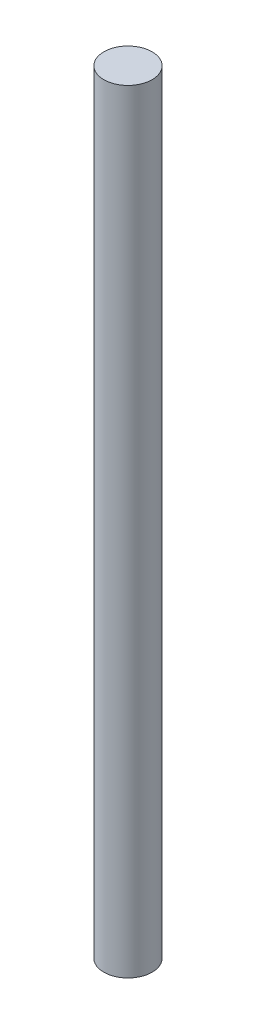
ISO-10303-21;
HEADER;
FILE_DESCRIPTION(('STEP AP214'),'2;1');
FILE_NAME('part.step','',(''),(''),'','','');
FILE_SCHEMA(('AUTOMOTIVE_DESIGN { 1 0 10303 214 1 1 1 1 }'));
ENDSEC;
DATA;
#1=APPLICATION_CONTEXT('core data for automotive mechanical design processes');
#2=APPLICATION_PROTOCOL_DEFINITION('international standard','automotive_design',2000,#1);
#3=PRODUCT_CONTEXT('',#1,'mechanical');
#4=PRODUCT('Part','Part','',(#3));
#5=PRODUCT_RELATED_PRODUCT_CATEGORY('part','',(#4));
#6=PRODUCT_DEFINITION_FORMATION('','',#4);
#7=PRODUCT_DEFINITION_CONTEXT('part definition',#1,'design');
#8=PRODUCT_DEFINITION('design','',#6,#7);
#9=PRODUCT_DEFINITION_SHAPE('','',#8);
#10=(LENGTH_UNIT() NAMED_UNIT(*) SI_UNIT(.MILLI.,.METRE.));
#11=(NAMED_UNIT(*) PLANE_ANGLE_UNIT() SI_UNIT($,.RADIAN.));
#12=(NAMED_UNIT(*) SI_UNIT($,.STERADIAN.) SOLID_ANGLE_UNIT());
#13=UNCERTAINTY_MEASURE_WITH_UNIT(LENGTH_MEASURE(1.E-05),#10,'distance_accuracy_value','');
#14=(GEOMETRIC_REPRESENTATION_CONTEXT(3) GLOBAL_UNCERTAINTY_ASSIGNED_CONTEXT((#13)) GLOBAL_UNIT_ASSIGNED_CONTEXT((#10,
#11,#12)) REPRESENTATION_CONTEXT('',''));
#15=CARTESIAN_POINT('',(0.,0.,0.));
#16=DIRECTION('',(0.,0.,1.));
#17=DIRECTION('',(1.,0.,0.));
#18=AXIS2_PLACEMENT_3D('',#15,#16,#17);
#19=CARTESIAN_POINT('',(0.,304.8,0.));
#20=DIRECTION('',(0.,-1.,0.));
#21=DIRECTION('',(0.,0.,-1.));
#22=AXIS2_PLACEMENT_3D('',#19,#20,#21);
#23=CYLINDRICAL_SURFACE('',#22,9.525);
#24=CARTESIAN_POINT('',(0.,304.8,0.));
#25=DIRECTION('',(0.,1.,0.));
#26=DIRECTION('',(0.,0.,1.));
#27=AXIS2_PLACEMENT_3D('',#24,#25,#26);
#28=CIRCLE('',#27,9.525);
#29=CARTESIAN_POINT('',(0.,304.8,9.525));
#30=VERTEX_POINT('',#29);
#31=EDGE_CURVE('E10',#30,#30,#28,.T.);
#32=ORIENTED_EDGE('',*,*,#31,.F.);
#33=EDGE_LOOP('',(#32));
#34=FACE_BOUND('',#33,.T.);
#35=CARTESIAN_POINT('',(0.,0.,0.));
#36=DIRECTION('',(0.,1.,0.));
#37=DIRECTION('',(0.,0.,1.));
#38=AXIS2_PLACEMENT_3D('',#35,#36,#37);
#39=CIRCLE('',#38,9.525);
#40=CARTESIAN_POINT('',(0.,0.,9.525));
#41=VERTEX_POINT('',#40);
#42=EDGE_CURVE('E36',#41,#41,#39,.T.);
#43=ORIENTED_EDGE('',*,*,#42,.T.);
#44=EDGE_LOOP('',(#43));
#45=FACE_BOUND('',#44,.T.);
#46=ADVANCED_FACE('F33',(#34,#45),#23,.T.);
#47=CARTESIAN_POINT('',(0.,304.8,0.));
#48=DIRECTION('',(0.,1.,0.));
#49=DIRECTION('',(0.,0.,1.));
#50=AXIS2_PLACEMENT_3D('',#47,#48,#49);
#51=PLANE('',#50);
#52=ORIENTED_EDGE('',*,*,#31,.T.);
#53=EDGE_LOOP('',(#52));
#54=FACE_BOUND('',#53,.T.);
#55=ADVANCED_FACE('F48',(#54),#51,.T.);
#56=CARTESIAN_POINT('',(0.,0.,0.));
#57=DIRECTION('',(0.,1.,0.));
#58=DIRECTION('',(0.,0.,1.));
#59=AXIS2_PLACEMENT_3D('',#56,#57,#58);
#60=PLANE('',#59);
#61=ORIENTED_EDGE('',*,*,#42,.F.);
#62=EDGE_LOOP('',(#61));
#63=FACE_BOUND('',#62,.T.);
#64=ADVANCED_FACE('F46',(#63),#60,.F.);
#65=CLOSED_SHELL('',(#46,#55,#64));
#66=MANIFOLD_SOLID_BREP('B2',#65);
#67=ADVANCED_BREP_SHAPE_REPRESENTATION('',(#18,#66),#14);
#68=SHAPE_DEFINITION_REPRESENTATION(#9,#67);
ENDSEC;
END-ISO-10303-21;
